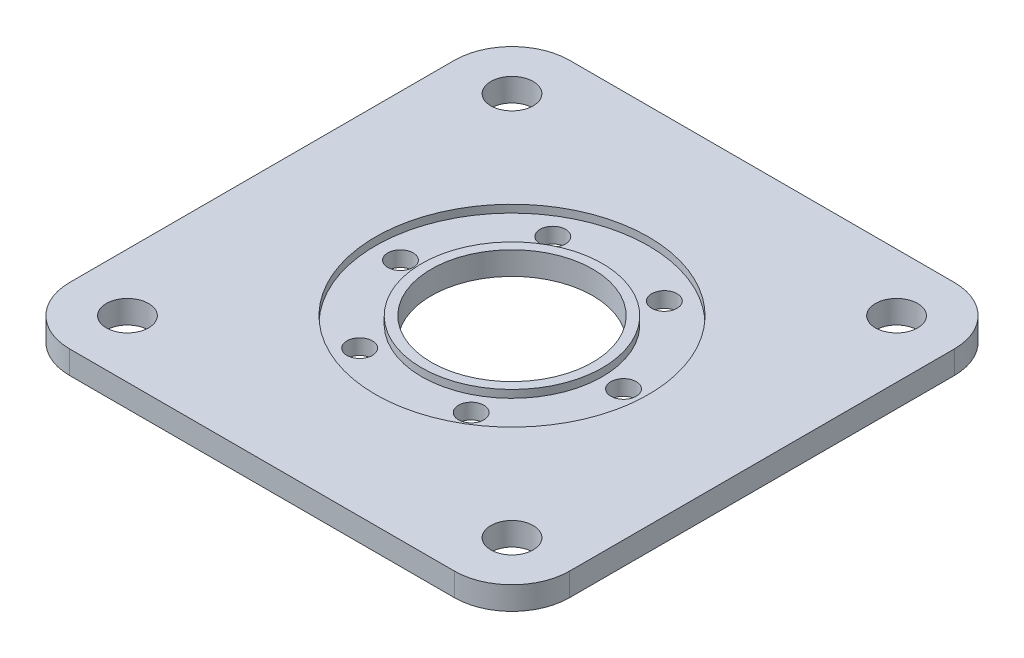
ISO-10303-21;
HEADER;
FILE_DESCRIPTION(('STEP AP214'),'2;1');
FILE_NAME('part.step','',(''),(''),'','','');
FILE_SCHEMA(('AUTOMOTIVE_DESIGN { 1 0 10303 214 1 1 1 1 }'));
ENDSEC;
DATA;
#1=APPLICATION_CONTEXT('core data for automotive mechanical design processes');
#2=APPLICATION_PROTOCOL_DEFINITION('international standard','automotive_design',2000,#1);
#3=PRODUCT_CONTEXT('',#1,'mechanical');
#4=PRODUCT('Part','Part','',(#3));
#5=PRODUCT_RELATED_PRODUCT_CATEGORY('part','',(#4));
#6=PRODUCT_DEFINITION_FORMATION('','',#4);
#7=PRODUCT_DEFINITION_CONTEXT('part definition',#1,'design');
#8=PRODUCT_DEFINITION('design','',#6,#7);
#9=PRODUCT_DEFINITION_SHAPE('','',#8);
#10=(LENGTH_UNIT() NAMED_UNIT(*) SI_UNIT(.MILLI.,.METRE.));
#11=(NAMED_UNIT(*) PLANE_ANGLE_UNIT() SI_UNIT($,.RADIAN.));
#12=(NAMED_UNIT(*) SI_UNIT($,.STERADIAN.) SOLID_ANGLE_UNIT());
#13=UNCERTAINTY_MEASURE_WITH_UNIT(LENGTH_MEASURE(1.E-05),#10,'distance_accuracy_value','');
#14=(GEOMETRIC_REPRESENTATION_CONTEXT(3) GLOBAL_UNCERTAINTY_ASSIGNED_CONTEXT((#13)) GLOBAL_UNIT_ASSIGNED_CONTEXT((#10,
#11,#12)) REPRESENTATION_CONTEXT('',''));
#15=CARTESIAN_POINT('',(0.,0.,0.));
#16=DIRECTION('',(0.,0.,1.));
#17=DIRECTION('',(1.,0.,0.));
#18=AXIS2_PLACEMENT_3D('',#15,#16,#17);
#19=CARTESIAN_POINT('',(-50.,6.,50.));
#20=DIRECTION('',(0.,-1.,0.));
#21=DIRECTION('',(0.,0.,-1.));
#22=AXIS2_PLACEMENT_3D('',#19,#20,#21);
#23=PLANE('',#22);
#24=CARTESIAN_POINT('',(0.,6.,0.));
#25=DIRECTION('',(0.,1.,0.));
#26=DIRECTION('',(0.,0.,1.));
#27=AXIS2_PLACEMENT_3D('',#24,#25,#26);
#28=CIRCLE('',#27,21.);
#29=CARTESIAN_POINT('',(0.,6.,21.));
#30=VERTEX_POINT('',#29);
#31=EDGE_CURVE('E135',#30,#30,#28,.T.);
#32=ORIENTED_EDGE('',*,*,#31,.F.);
#33=EDGE_LOOP('',(#32));
#34=FACE_BOUND('',#33,.T.);
#35=CARTESIAN_POINT('',(0.,6.,0.));
#36=DIRECTION('',(0.,1.,0.));
#37=DIRECTION('',(0.,0.,1.));
#38=AXIS2_PLACEMENT_3D('',#35,#36,#37);
#39=CIRCLE('',#38,23.5);
#40=CARTESIAN_POINT('',(0.,6.,23.5));
#41=VERTEX_POINT('',#40);
#42=EDGE_CURVE('E192',#41,#41,#39,.T.);
#43=ORIENTED_EDGE('',*,*,#42,.T.);
#44=EDGE_LOOP('',(#43));
#45=FACE_BOUND('',#44,.T.);
#46=ADVANCED_FACE('F34',(#34,#45),#23,.F.);
#47=CARTESIAN_POINT('',(-50.,6.,50.));
#48=DIRECTION('',(0.,-1.,0.));
#49=DIRECTION('',(0.,0.,-1.));
#50=AXIS2_PLACEMENT_3D('',#47,#48,#49);
#51=CIRCLE('',#50,5.5);
#52=CARTESIAN_POINT('',(-50.,6.,44.5));
#53=VERTEX_POINT('',#52);
#54=EDGE_CURVE('E195',#53,#53,#51,.T.);
#55=ORIENTED_EDGE('',*,*,#54,.T.);
#56=EDGE_LOOP('',(#55));
#57=FACE_BOUND('',#56,.T.);
#58=CARTESIAN_POINT('',(50.,6.,50.));
#59=DIRECTION('',(0.,-1.,0.));
#60=DIRECTION('',(0.,0.,-1.));
#61=AXIS2_PLACEMENT_3D('',#58,#59,#60);
#62=CIRCLE('',#61,5.5);
#63=CARTESIAN_POINT('',(50.,6.,44.5));
#64=VERTEX_POINT('',#63);
#65=EDGE_CURVE('E200',#64,#64,#62,.T.);
#66=ORIENTED_EDGE('',*,*,#65,.T.);
#67=EDGE_LOOP('',(#66));
#68=FACE_BOUND('',#67,.T.);
#69=CARTESIAN_POINT('',(50.,6.,-50.));
#70=DIRECTION('',(0.,-1.,0.));
#71=DIRECTION('',(0.,0.,-1.));
#72=AXIS2_PLACEMENT_3D('',#69,#70,#71);
#73=CIRCLE('',#72,5.5);
#74=CARTESIAN_POINT('',(50.,6.,-55.5));
#75=VERTEX_POINT('',#74);
#76=EDGE_CURVE('E203',#75,#75,#73,.T.);
#77=ORIENTED_EDGE('',*,*,#76,.T.);
#78=EDGE_LOOP('',(#77));
#79=FACE_BOUND('',#78,.T.);
#80=CARTESIAN_POINT('',(-50.,6.,-50.));
#81=DIRECTION('',(0.,-1.,0.));
#82=DIRECTION('',(0.,0.,-1.));
#83=AXIS2_PLACEMENT_3D('',#80,#81,#82);
#84=CIRCLE('',#83,5.5);
#85=CARTESIAN_POINT('',(-50.,6.,-55.5));
#86=VERTEX_POINT('',#85);
#87=EDGE_CURVE('E206',#86,#86,#84,.T.);
#88=ORIENTED_EDGE('',*,*,#87,.T.);
#89=EDGE_LOOP('',(#88));
#90=FACE_BOUND('',#89,.T.);
#91=CARTESIAN_POINT('',(0.,6.,0.));
#92=DIRECTION('',(0.,1.,0.));
#93=DIRECTION('',(0.,0.,1.));
#94=AXIS2_PLACEMENT_3D('',#91,#92,#93);
#95=CIRCLE('',#94,35.5);
#96=CARTESIAN_POINT('',(0.,6.,35.5));
#97=VERTEX_POINT('',#96);
#98=EDGE_CURVE('E186',#97,#97,#95,.T.);
#99=ORIENTED_EDGE('',*,*,#98,.F.);
#100=EDGE_LOOP('',(#99));
#101=FACE_BOUND('',#100,.T.);
#102=CARTESIAN_POINT('',(-50.,6.,50.));
#103=DIRECTION('',(0.,1.,0.));
#104=DIRECTION('',(0.,0.,-1.));
#105=AXIS2_PLACEMENT_3D('',#102,#103,#104);
#106=CIRCLE('',#105,15.);
#107=CARTESIAN_POINT('',(-65.,6.,50.));
#108=VERTEX_POINT('',#107);
#109=CARTESIAN_POINT('',(-50.,6.,65.));
#110=VERTEX_POINT('',#109);
#111=EDGE_CURVE('E146',#108,#110,#106,.T.);
#112=ORIENTED_EDGE('',*,*,#111,.T.);
#113=DIRECTION('',(1.,0.,0.));
#114=VECTOR('',#113,1.);
#115=CARTESIAN_POINT('',(-50.,6.,65.));
#116=LINE('',#115,#114);
#117=CARTESIAN_POINT('',(50.,6.,65.));
#118=VERTEX_POINT('',#117);
#119=EDGE_CURVE('E94',#110,#118,#116,.T.);
#120=ORIENTED_EDGE('',*,*,#119,.T.);
#121=CARTESIAN_POINT('',(50.,6.,50.));
#122=DIRECTION('',(0.,1.,0.));
#123=DIRECTION('',(0.,0.,1.));
#124=AXIS2_PLACEMENT_3D('',#121,#122,#123);
#125=CIRCLE('',#124,15.);
#126=CARTESIAN_POINT('',(65.,6.,50.));
#127=VERTEX_POINT('',#126);
#128=EDGE_CURVE('E161',#118,#127,#125,.T.);
#129=ORIENTED_EDGE('',*,*,#128,.T.);
#130=DIRECTION('',(0.,0.,-1.));
#131=VECTOR('',#130,1.);
#132=CARTESIAN_POINT('',(65.,6.,50.));
#133=LINE('',#132,#131);
#134=CARTESIAN_POINT('',(65.,6.,-50.));
#135=VERTEX_POINT('',#134);
#136=EDGE_CURVE('E174',#127,#135,#133,.T.);
#137=ORIENTED_EDGE('',*,*,#136,.T.);
#138=CARTESIAN_POINT('',(50.,6.,-50.));
#139=DIRECTION('',(0.,1.,0.));
#140=DIRECTION('',(0.,0.,1.));
#141=AXIS2_PLACEMENT_3D('',#138,#139,#140);
#142=CIRCLE('',#141,15.);
#143=CARTESIAN_POINT('',(50.,6.,-65.));
#144=VERTEX_POINT('',#143);
#145=EDGE_CURVE('E113',#135,#144,#142,.T.);
#146=ORIENTED_EDGE('',*,*,#145,.T.);
#147=DIRECTION('',(-1.,0.,0.));
#148=VECTOR('',#147,1.);
#149=CARTESIAN_POINT('',(-50.,6.,-65.));
#150=LINE('',#149,#148);
#151=CARTESIAN_POINT('',(-50.,6.,-65.));
#152=VERTEX_POINT('',#151);
#153=EDGE_CURVE('E107',#144,#152,#150,.T.);
#154=ORIENTED_EDGE('',*,*,#153,.T.);
#155=CARTESIAN_POINT('',(-50.,6.,-50.));
#156=DIRECTION('',(0.,1.,0.));
#157=DIRECTION('',(0.,0.,-1.));
#158=AXIS2_PLACEMENT_3D('',#155,#156,#157);
#159=CIRCLE('',#158,15.);
#160=CARTESIAN_POINT('',(-65.,6.,-50.));
#161=VERTEX_POINT('',#160);
#162=EDGE_CURVE('E111',#152,#161,#159,.T.);
#163=ORIENTED_EDGE('',*,*,#162,.T.);
#164=DIRECTION('',(0.,0.,1.));
#165=VECTOR('',#164,1.);
#166=CARTESIAN_POINT('',(-65.,6.,50.));
#167=LINE('',#166,#165);
#168=EDGE_CURVE('E51',#161,#108,#167,.T.);
#169=ORIENTED_EDGE('',*,*,#168,.T.);
#170=EDGE_LOOP('',(#112,#120,#129,#137,#146,#154,#163,#169));
#171=FACE_BOUND('',#170,.T.);
#172=ADVANCED_FACE('F109',(#57,#68,#79,#90,#101,#171),#23,.F.);
#173=CARTESIAN_POINT('',(-50.,0.,50.));
#174=DIRECTION('',(0.,-1.,0.));
#175=DIRECTION('',(0.,0.,-1.));
#176=AXIS2_PLACEMENT_3D('',#173,#174,#175);
#177=PLANE('',#176);
#178=CARTESIAN_POINT('',(-14.5000000000003,0.,-25.1147367097486));
#179=DIRECTION('',(0.,-1.,0.));
#180=DIRECTION('',(0.,0.,-1.));
#181=AXIS2_PLACEMENT_3D('',#178,#179,#180);
#182=CIRCLE('',#181,3.29999999999999);
#183=CARTESIAN_POINT('',(-14.5000000000003,0.,-28.4147367097485));
#184=VERTEX_POINT('',#183);
#185=EDGE_CURVE('E251',#184,#184,#182,.T.);
#186=ORIENTED_EDGE('',*,*,#185,.F.);
#187=EDGE_LOOP('',(#186));
#188=FACE_BOUND('',#187,.T.);
#189=CARTESIAN_POINT('',(14.4999999999998,0.,-25.1147367097489));
#190=DIRECTION('',(0.,-1.,0.));
#191=DIRECTION('',(0.,0.,-1.));
#192=AXIS2_PLACEMENT_3D('',#189,#190,#191);
#193=CIRCLE('',#192,3.29999999999999);
#194=CARTESIAN_POINT('',(14.4999999999998,0.,-28.4147367097488));
#195=VERTEX_POINT('',#194);
#196=EDGE_CURVE('E245',#195,#195,#193,.T.);
#197=ORIENTED_EDGE('',*,*,#196,.F.);
#198=EDGE_LOOP('',(#197));
#199=FACE_BOUND('',#198,.T.);
#200=CARTESIAN_POINT('',(29.,0.,0.));
#201=DIRECTION('',(0.,-1.,0.));
#202=DIRECTION('',(0.,0.,-1.));
#203=AXIS2_PLACEMENT_3D('',#200,#201,#202);
#204=CIRCLE('',#203,3.29999999999999);
#205=CARTESIAN_POINT('',(29.,0.,-3.29999999999999));
#206=VERTEX_POINT('',#205);
#207=EDGE_CURVE('E239',#206,#206,#204,.T.);
#208=ORIENTED_EDGE('',*,*,#207,.F.);
#209=EDGE_LOOP('',(#208));
#210=FACE_BOUND('',#209,.T.);
#211=CARTESIAN_POINT('',(14.5000000000001,0.,25.1147367097487));
#212=DIRECTION('',(0.,-1.,0.));
#213=DIRECTION('',(0.,0.,-1.));
#214=AXIS2_PLACEMENT_3D('',#211,#212,#213);
#215=CIRCLE('',#214,3.29999999999999);
#216=CARTESIAN_POINT('',(14.5000000000001,0.,21.8147367097487));
#217=VERTEX_POINT('',#216);
#218=EDGE_CURVE('E233',#217,#217,#215,.T.);
#219=ORIENTED_EDGE('',*,*,#218,.F.);
#220=EDGE_LOOP('',(#219));
#221=FACE_BOUND('',#220,.T.);
#222=CARTESIAN_POINT('',(-14.4999999999999,0.,25.1147367097488));
#223=DIRECTION('',(0.,-1.,0.));
#224=DIRECTION('',(0.,0.,-1.));
#225=AXIS2_PLACEMENT_3D('',#222,#223,#224);
#226=CIRCLE('',#225,3.29999999999999);
#227=CARTESIAN_POINT('',(-14.4999999999999,0.,21.8147367097488));
#228=VERTEX_POINT('',#227);
#229=EDGE_CURVE('E227',#228,#228,#226,.T.);
#230=ORIENTED_EDGE('',*,*,#229,.F.);
#231=EDGE_LOOP('',(#230));
#232=FACE_BOUND('',#231,.T.);
#233=CARTESIAN_POINT('',(-29.,0.,0.));
#234=DIRECTION('',(0.,-1.,0.));
#235=DIRECTION('',(0.,0.,-1.));
#236=AXIS2_PLACEMENT_3D('',#233,#234,#235);
#237=CIRCLE('',#236,3.29999999999999);
#238=CARTESIAN_POINT('',(-29.,0.,-3.29999999999999));
#239=VERTEX_POINT('',#238);
#240=EDGE_CURVE('E217',#239,#239,#237,.T.);
#241=ORIENTED_EDGE('',*,*,#240,.F.);
#242=EDGE_LOOP('',(#241));
#243=FACE_BOUND('',#242,.T.);
#244=CARTESIAN_POINT('',(-50.,0.,50.));
#245=DIRECTION('',(0.,1.,0.));
#246=DIRECTION('',(0.,0.,1.));
#247=AXIS2_PLACEMENT_3D('',#244,#245,#246);
#248=CIRCLE('',#247,5.5);
#249=CARTESIAN_POINT('',(-50.,0.,55.5));
#250=VERTEX_POINT('',#249);
#251=EDGE_CURVE('E213',#250,#250,#248,.T.);
#252=ORIENTED_EDGE('',*,*,#251,.T.);
#253=EDGE_LOOP('',(#252));
#254=FACE_BOUND('',#253,.T.);
#255=CARTESIAN_POINT('',(50.,0.,50.));
#256=DIRECTION('',(0.,1.,0.));
#257=DIRECTION('',(0.,0.,1.));
#258=AXIS2_PLACEMENT_3D('',#255,#256,#257);
#259=CIRCLE('',#258,5.5);
#260=CARTESIAN_POINT('',(50.,0.,55.5));
#261=VERTEX_POINT('',#260);
#262=EDGE_CURVE('E216',#261,#261,#259,.T.);
#263=ORIENTED_EDGE('',*,*,#262,.T.);
#264=EDGE_LOOP('',(#263));
#265=FACE_BOUND('',#264,.T.);
#266=CARTESIAN_POINT('',(50.,0.,-50.));
#267=DIRECTION('',(0.,1.,0.));
#268=DIRECTION('',(0.,0.,1.));
#269=AXIS2_PLACEMENT_3D('',#266,#267,#268);
#270=CIRCLE('',#269,5.5);
#271=CARTESIAN_POINT('',(50.,0.,-44.5));
#272=VERTEX_POINT('',#271);
#273=EDGE_CURVE('E212',#272,#272,#270,.T.);
#274=ORIENTED_EDGE('',*,*,#273,.T.);
#275=EDGE_LOOP('',(#274));
#276=FACE_BOUND('',#275,.T.);
#277=CARTESIAN_POINT('',(-50.,0.,-50.));
#278=DIRECTION('',(0.,1.,0.));
#279=DIRECTION('',(0.,0.,1.));
#280=AXIS2_PLACEMENT_3D('',#277,#278,#279);
#281=CIRCLE('',#280,5.5);
#282=CARTESIAN_POINT('',(-50.,0.,-44.5));
#283=VERTEX_POINT('',#282);
#284=EDGE_CURVE('E209',#283,#283,#281,.T.);
#285=ORIENTED_EDGE('',*,*,#284,.T.);
#286=EDGE_LOOP('',(#285));
#287=FACE_BOUND('',#286,.T.);
#288=CARTESIAN_POINT('',(-50.,0.,50.));
#289=DIRECTION('',(0.,1.,0.));
#290=DIRECTION('',(0.,0.,-1.));
#291=AXIS2_PLACEMENT_3D('',#288,#289,#290);
#292=CIRCLE('',#291,15.);
#293=CARTESIAN_POINT('',(-65.,0.,50.));
#294=VERTEX_POINT('',#293);
#295=CARTESIAN_POINT('',(-50.,0.,65.));
#296=VERTEX_POINT('',#295);
#297=EDGE_CURVE('E131',#294,#296,#292,.T.);
#298=ORIENTED_EDGE('',*,*,#297,.F.);
#299=DIRECTION('',(0.,0.,1.));
#300=VECTOR('',#299,1.);
#301=CARTESIAN_POINT('',(-65.,0.,50.));
#302=LINE('',#301,#300);
#303=CARTESIAN_POINT('',(-65.,0.,-50.));
#304=VERTEX_POINT('',#303);
#305=EDGE_CURVE('E86',#304,#294,#302,.T.);
#306=ORIENTED_EDGE('',*,*,#305,.F.);
#307=CARTESIAN_POINT('',(-50.,0.,-50.));
#308=DIRECTION('',(0.,1.,0.));
#309=DIRECTION('',(0.,0.,-1.));
#310=AXIS2_PLACEMENT_3D('',#307,#308,#309);
#311=CIRCLE('',#310,15.);
#312=CARTESIAN_POINT('',(-50.,0.,-65.));
#313=VERTEX_POINT('',#312);
#314=EDGE_CURVE('E80',#313,#304,#311,.T.);
#315=ORIENTED_EDGE('',*,*,#314,.F.);
#316=DIRECTION('',(-1.,0.,0.));
#317=VECTOR('',#316,1.);
#318=CARTESIAN_POINT('',(-50.,0.,-65.));
#319=LINE('',#318,#317);
#320=CARTESIAN_POINT('',(50.,0.,-65.));
#321=VERTEX_POINT('',#320);
#322=EDGE_CURVE('E121',#321,#313,#319,.T.);
#323=ORIENTED_EDGE('',*,*,#322,.F.);
#324=CARTESIAN_POINT('',(50.,0.,-50.));
#325=DIRECTION('',(0.,1.,0.));
#326=DIRECTION('',(0.,0.,1.));
#327=AXIS2_PLACEMENT_3D('',#324,#325,#326);
#328=CIRCLE('',#327,15.);
#329=CARTESIAN_POINT('',(65.,0.,-50.));
#330=VERTEX_POINT('',#329);
#331=EDGE_CURVE('E141',#330,#321,#328,.T.);
#332=ORIENTED_EDGE('',*,*,#331,.F.);
#333=DIRECTION('',(0.,0.,-1.));
#334=VECTOR('',#333,1.);
#335=CARTESIAN_POINT('',(65.,0.,50.));
#336=LINE('',#335,#334);
#337=CARTESIAN_POINT('',(65.,0.,50.));
#338=VERTEX_POINT('',#337);
#339=EDGE_CURVE('E139',#338,#330,#336,.T.);
#340=ORIENTED_EDGE('',*,*,#339,.F.);
#341=CARTESIAN_POINT('',(50.,0.,50.));
#342=DIRECTION('',(0.,1.,0.));
#343=DIRECTION('',(0.,0.,1.));
#344=AXIS2_PLACEMENT_3D('',#341,#342,#343);
#345=CIRCLE('',#344,15.);
#346=CARTESIAN_POINT('',(50.,0.,65.));
#347=VERTEX_POINT('',#346);
#348=EDGE_CURVE('E137',#347,#338,#345,.T.);
#349=ORIENTED_EDGE('',*,*,#348,.F.);
#350=DIRECTION('',(1.,0.,0.));
#351=VECTOR('',#350,1.);
#352=CARTESIAN_POINT('',(-50.,0.,65.));
#353=LINE('',#352,#351);
#354=EDGE_CURVE('E134',#296,#347,#353,.T.);
#355=ORIENTED_EDGE('',*,*,#354,.F.);
#356=EDGE_LOOP('',(#298,#306,#315,#323,#332,#340,#349,#355));
#357=FACE_BOUND('',#356,.T.);
#358=CARTESIAN_POINT('',(0.,0.,0.));
#359=DIRECTION('',(0.,1.,0.));
#360=DIRECTION('',(0.,0.,1.));
#361=AXIS2_PLACEMENT_3D('',#358,#359,#360);
#362=CIRCLE('',#361,21.);
#363=CARTESIAN_POINT('',(0.,0.,21.));
#364=VERTEX_POINT('',#363);
#365=EDGE_CURVE('E180',#364,#364,#362,.T.);
#366=ORIENTED_EDGE('',*,*,#365,.T.);
#367=EDGE_LOOP('',(#366));
#368=FACE_BOUND('',#367,.T.);
#369=ADVANCED_FACE('F165',(#188,#199,#210,#221,#232,#243,#254,#265,#276,#287,#357,#368),#177,.T.);
#370=CARTESIAN_POINT('',(-50.,6.,50.));
#371=DIRECTION('',(0.,-1.,0.));
#372=DIRECTION('',(0.,0.,-1.));
#373=AXIS2_PLACEMENT_3D('',#370,#371,#372);
#374=CYLINDRICAL_SURFACE('',#373,15.);
#375=ORIENTED_EDGE('',*,*,#297,.T.);
#376=DIRECTION('',(0.,-1.,0.));
#377=VECTOR('',#376,1.);
#378=CARTESIAN_POINT('',(-50.,6.,65.));
#379=LINE('',#378,#377);
#380=EDGE_CURVE('E11',#110,#296,#379,.T.);
#381=ORIENTED_EDGE('',*,*,#380,.F.);
#382=ORIENTED_EDGE('',*,*,#111,.F.);
#383=DIRECTION('',(0.,-1.,0.));
#384=VECTOR('',#383,1.);
#385=CARTESIAN_POINT('',(-65.,6.,50.));
#386=LINE('',#385,#384);
#387=EDGE_CURVE('E127',#108,#294,#386,.T.);
#388=ORIENTED_EDGE('',*,*,#387,.T.);
#389=EDGE_LOOP('',(#375,#381,#382,#388));
#390=FACE_BOUND('',#389,.T.);
#391=ADVANCED_FACE('F36',(#390),#374,.T.);
#392=CARTESIAN_POINT('',(-50.,6.,65.));
#393=DIRECTION('',(0.,0.,-1.));
#394=DIRECTION('',(-1.,0.,0.));
#395=AXIS2_PLACEMENT_3D('',#392,#393,#394);
#396=PLANE('',#395);
#397=ORIENTED_EDGE('',*,*,#354,.T.);
#398=DIRECTION('',(0.,-1.,0.));
#399=VECTOR('',#398,1.);
#400=CARTESIAN_POINT('',(50.,6.,65.));
#401=LINE('',#400,#399);
#402=EDGE_CURVE('E43',#118,#347,#401,.T.);
#403=ORIENTED_EDGE('',*,*,#402,.F.);
#404=ORIENTED_EDGE('',*,*,#119,.F.);
#405=ORIENTED_EDGE('',*,*,#380,.T.);
#406=EDGE_LOOP('',(#397,#403,#404,#405));
#407=FACE_BOUND('',#406,.T.);
#408=ADVANCED_FACE('F312',(#407),#396,.F.);
#409=CARTESIAN_POINT('',(50.,6.,50.));
#410=DIRECTION('',(0.,-1.,0.));
#411=DIRECTION('',(0.,0.,-1.));
#412=AXIS2_PLACEMENT_3D('',#409,#410,#411);
#413=CYLINDRICAL_SURFACE('',#412,15.);
#414=ORIENTED_EDGE('',*,*,#348,.T.);
#415=DIRECTION('',(0.,-1.,0.));
#416=VECTOR('',#415,1.);
#417=CARTESIAN_POINT('',(65.,6.,50.));
#418=LINE('',#417,#416);
#419=EDGE_CURVE('E153',#127,#338,#418,.T.);
#420=ORIENTED_EDGE('',*,*,#419,.F.);
#421=ORIENTED_EDGE('',*,*,#128,.F.);
#422=ORIENTED_EDGE('',*,*,#402,.T.);
#423=EDGE_LOOP('',(#414,#420,#421,#422));
#424=FACE_BOUND('',#423,.T.);
#425=ADVANCED_FACE('F159',(#424),#413,.T.);
#426=CARTESIAN_POINT('',(65.,6.,50.));
#427=DIRECTION('',(-1.,0.,0.));
#428=DIRECTION('',(0.,0.,1.));
#429=AXIS2_PLACEMENT_3D('',#426,#427,#428);
#430=PLANE('',#429);
#431=ORIENTED_EDGE('',*,*,#339,.T.);
#432=DIRECTION('',(0.,-1.,0.));
#433=VECTOR('',#432,1.);
#434=CARTESIAN_POINT('',(65.,6.,-50.));
#435=LINE('',#434,#433);
#436=EDGE_CURVE('E150',#135,#330,#435,.T.);
#437=ORIENTED_EDGE('',*,*,#436,.F.);
#438=ORIENTED_EDGE('',*,*,#136,.F.);
#439=ORIENTED_EDGE('',*,*,#419,.T.);
#440=EDGE_LOOP('',(#431,#437,#438,#439));
#441=FACE_BOUND('',#440,.T.);
#442=ADVANCED_FACE('F170',(#441),#430,.F.);
#443=CARTESIAN_POINT('',(50.,6.,-50.));
#444=DIRECTION('',(0.,-1.,0.));
#445=DIRECTION('',(0.,0.,-1.));
#446=AXIS2_PLACEMENT_3D('',#443,#444,#445);
#447=CYLINDRICAL_SURFACE('',#446,15.);
#448=ORIENTED_EDGE('',*,*,#331,.T.);
#449=DIRECTION('',(0.,-1.,0.));
#450=VECTOR('',#449,1.);
#451=CARTESIAN_POINT('',(50.,6.,-65.));
#452=LINE('',#451,#450);
#453=EDGE_CURVE('E122',#144,#321,#452,.T.);
#454=ORIENTED_EDGE('',*,*,#453,.F.);
#455=ORIENTED_EDGE('',*,*,#145,.F.);
#456=ORIENTED_EDGE('',*,*,#436,.T.);
#457=EDGE_LOOP('',(#448,#454,#455,#456));
#458=FACE_BOUND('',#457,.T.);
#459=ADVANCED_FACE('F173',(#458),#447,.T.);
#460=CARTESIAN_POINT('',(-50.,6.,-65.));
#461=DIRECTION('',(0.,0.,1.));
#462=DIRECTION('',(1.,0.,0.));
#463=AXIS2_PLACEMENT_3D('',#460,#461,#462);
#464=PLANE('',#463);
#465=ORIENTED_EDGE('',*,*,#322,.T.);
#466=DIRECTION('',(0.,-1.,0.));
#467=VECTOR('',#466,1.);
#468=CARTESIAN_POINT('',(-50.,6.,-65.));
#469=LINE('',#468,#467);
#470=EDGE_CURVE('E118',#152,#313,#469,.T.);
#471=ORIENTED_EDGE('',*,*,#470,.F.);
#472=ORIENTED_EDGE('',*,*,#153,.F.);
#473=ORIENTED_EDGE('',*,*,#453,.T.);
#474=EDGE_LOOP('',(#465,#471,#472,#473));
#475=FACE_BOUND('',#474,.T.);
#476=ADVANCED_FACE('F119',(#475),#464,.F.);
#477=CARTESIAN_POINT('',(-50.,6.,-50.));
#478=DIRECTION('',(0.,-1.,0.));
#479=DIRECTION('',(0.,0.,-1.));
#480=AXIS2_PLACEMENT_3D('',#477,#478,#479);
#481=CYLINDRICAL_SURFACE('',#480,15.);
#482=ORIENTED_EDGE('',*,*,#314,.T.);
#483=DIRECTION('',(0.,-1.,0.));
#484=VECTOR('',#483,1.);
#485=CARTESIAN_POINT('',(-65.,6.,-50.));
#486=LINE('',#485,#484);
#487=EDGE_CURVE('E123',#161,#304,#486,.T.);
#488=ORIENTED_EDGE('',*,*,#487,.F.);
#489=ORIENTED_EDGE('',*,*,#162,.F.);
#490=ORIENTED_EDGE('',*,*,#470,.T.);
#491=EDGE_LOOP('',(#482,#488,#489,#490));
#492=FACE_BOUND('',#491,.T.);
#493=ADVANCED_FACE('F125',(#492),#481,.T.);
#494=CARTESIAN_POINT('',(-65.,6.,50.));
#495=DIRECTION('',(1.,0.,0.));
#496=DIRECTION('',(0.,0.,-1.));
#497=AXIS2_PLACEMENT_3D('',#494,#495,#496);
#498=PLANE('',#497);
#499=ORIENTED_EDGE('',*,*,#305,.T.);
#500=ORIENTED_EDGE('',*,*,#387,.F.);
#501=ORIENTED_EDGE('',*,*,#168,.F.);
#502=ORIENTED_EDGE('',*,*,#487,.T.);
#503=EDGE_LOOP('',(#499,#500,#501,#502));
#504=FACE_BOUND('',#503,.T.);
#505=ADVANCED_FACE('F300',(#504),#498,.F.);
#506=CARTESIAN_POINT('',(0.,6.,0.));
#507=DIRECTION('',(0.,-1.,0.));
#508=DIRECTION('',(0.,0.,-1.));
#509=AXIS2_PLACEMENT_3D('',#506,#507,#508);
#510=CYLINDRICAL_SURFACE('',#509,21.);
#511=ORIENTED_EDGE('',*,*,#31,.T.);
#512=EDGE_LOOP('',(#511));
#513=FACE_BOUND('',#512,.T.);
#514=ORIENTED_EDGE('',*,*,#365,.F.);
#515=EDGE_LOOP('',(#514));
#516=FACE_BOUND('',#515,.T.);
#517=ADVANCED_FACE('F283',(#513,#516),#510,.F.);
#518=CARTESIAN_POINT('',(0.,4.,0.));
#519=DIRECTION('',(0.,1.,0.));
#520=DIRECTION('',(0.,0.,1.));
#521=AXIS2_PLACEMENT_3D('',#518,#519,#520);
#522=CYLINDRICAL_SURFACE('',#521,35.5);
#523=CARTESIAN_POINT('',(0.,4.,0.));
#524=DIRECTION('',(0.,1.,0.));
#525=DIRECTION('',(0.,0.,1.));
#526=AXIS2_PLACEMENT_3D('',#523,#524,#525);
#527=CIRCLE('',#526,35.5);
#528=CARTESIAN_POINT('',(0.,4.,35.5));
#529=VERTEX_POINT('',#528);
#530=EDGE_CURVE('E183',#529,#529,#527,.T.);
#531=ORIENTED_EDGE('',*,*,#530,.F.);
#532=EDGE_LOOP('',(#531));
#533=FACE_BOUND('',#532,.T.);
#534=ORIENTED_EDGE('',*,*,#98,.T.);
#535=EDGE_LOOP('',(#534));
#536=FACE_BOUND('',#535,.T.);
#537=ADVANCED_FACE('F265',(#533,#536),#522,.F.);
#538=CARTESIAN_POINT('',(0.,4.,0.));
#539=DIRECTION('',(0.,1.,0.));
#540=DIRECTION('',(0.,0.,1.));
#541=AXIS2_PLACEMENT_3D('',#538,#539,#540);
#542=PLANE('',#541);
#543=CARTESIAN_POINT('',(-14.5000000000003,4.,-25.1147367097486));
#544=DIRECTION('',(0.,1.,0.));
#545=DIRECTION('',(0.,0.,1.));
#546=AXIS2_PLACEMENT_3D('',#543,#544,#545);
#547=CIRCLE('',#546,3.29999999999999);
#548=CARTESIAN_POINT('',(-14.5000000000003,4.,-21.8147367097486));
#549=VERTEX_POINT('',#548);
#550=EDGE_CURVE('E254',#549,#549,#547,.T.);
#551=ORIENTED_EDGE('',*,*,#550,.F.);
#552=EDGE_LOOP('',(#551));
#553=FACE_BOUND('',#552,.T.);
#554=CARTESIAN_POINT('',(14.4999999999998,4.,-25.1147367097489));
#555=DIRECTION('',(0.,1.,0.));
#556=DIRECTION('',(0.,0.,1.));
#557=AXIS2_PLACEMENT_3D('',#554,#555,#556);
#558=CIRCLE('',#557,3.29999999999999);
#559=CARTESIAN_POINT('',(14.4999999999998,4.,-21.8147367097489));
#560=VERTEX_POINT('',#559);
#561=EDGE_CURVE('E248',#560,#560,#558,.T.);
#562=ORIENTED_EDGE('',*,*,#561,.F.);
#563=EDGE_LOOP('',(#562));
#564=FACE_BOUND('',#563,.T.);
#565=CARTESIAN_POINT('',(29.,4.,0.));
#566=DIRECTION('',(0.,1.,0.));
#567=DIRECTION('',(0.,0.,1.));
#568=AXIS2_PLACEMENT_3D('',#565,#566,#567);
#569=CIRCLE('',#568,3.29999999999999);
#570=CARTESIAN_POINT('',(29.,4.,3.29999999999999));
#571=VERTEX_POINT('',#570);
#572=EDGE_CURVE('E242',#571,#571,#569,.T.);
#573=ORIENTED_EDGE('',*,*,#572,.F.);
#574=EDGE_LOOP('',(#573));
#575=FACE_BOUND('',#574,.T.);
#576=CARTESIAN_POINT('',(14.5000000000001,4.,25.1147367097487));
#577=DIRECTION('',(0.,1.,0.));
#578=DIRECTION('',(0.,0.,1.));
#579=AXIS2_PLACEMENT_3D('',#576,#577,#578);
#580=CIRCLE('',#579,3.29999999999999);
#581=CARTESIAN_POINT('',(14.5000000000001,4.,28.4147367097486));
#582=VERTEX_POINT('',#581);
#583=EDGE_CURVE('E236',#582,#582,#580,.T.);
#584=ORIENTED_EDGE('',*,*,#583,.F.);
#585=EDGE_LOOP('',(#584));
#586=FACE_BOUND('',#585,.T.);
#587=CARTESIAN_POINT('',(-14.4999999999999,4.,25.1147367097488));
#588=DIRECTION('',(0.,1.,0.));
#589=DIRECTION('',(0.,0.,1.));
#590=AXIS2_PLACEMENT_3D('',#587,#588,#589);
#591=CIRCLE('',#590,3.29999999999999);
#592=CARTESIAN_POINT('',(-14.4999999999999,4.,28.4147367097487));
#593=VERTEX_POINT('',#592);
#594=EDGE_CURVE('E230',#593,#593,#591,.T.);
#595=ORIENTED_EDGE('',*,*,#594,.F.);
#596=EDGE_LOOP('',(#595));
#597=FACE_BOUND('',#596,.T.);
#598=CARTESIAN_POINT('',(-29.,4.,0.));
#599=DIRECTION('',(0.,1.,0.));
#600=DIRECTION('',(0.,0.,1.));
#601=AXIS2_PLACEMENT_3D('',#598,#599,#600);
#602=CIRCLE('',#601,3.29999999999999);
#603=CARTESIAN_POINT('',(-29.,4.,3.29999999999999));
#604=VERTEX_POINT('',#603);
#605=EDGE_CURVE('E224',#604,#604,#602,.T.);
#606=ORIENTED_EDGE('',*,*,#605,.F.);
#607=EDGE_LOOP('',(#606));
#608=FACE_BOUND('',#607,.T.);
#609=CARTESIAN_POINT('',(0.,4.,0.));
#610=DIRECTION('',(0.,1.,0.));
#611=DIRECTION('',(0.,0.,1.));
#612=AXIS2_PLACEMENT_3D('',#609,#610,#611);
#613=CIRCLE('',#612,23.5);
#614=CARTESIAN_POINT('',(0.,4.,23.5));
#615=VERTEX_POINT('',#614);
#616=EDGE_CURVE('E189',#615,#615,#613,.T.);
#617=ORIENTED_EDGE('',*,*,#616,.F.);
#618=EDGE_LOOP('',(#617));
#619=FACE_BOUND('',#618,.T.);
#620=ORIENTED_EDGE('',*,*,#530,.T.);
#621=EDGE_LOOP('',(#620));
#622=FACE_BOUND('',#621,.T.);
#623=ADVANCED_FACE('F261',(#553,#564,#575,#586,#597,#608,#619,#622),#542,.T.);
#624=CARTESIAN_POINT('',(0.,4.,0.));
#625=DIRECTION('',(0.,1.,0.));
#626=DIRECTION('',(0.,0.,1.));
#627=AXIS2_PLACEMENT_3D('',#624,#625,#626);
#628=CYLINDRICAL_SURFACE('',#627,23.5);
#629=ORIENTED_EDGE('',*,*,#616,.T.);
#630=EDGE_LOOP('',(#629));
#631=FACE_BOUND('',#630,.T.);
#632=ORIENTED_EDGE('',*,*,#42,.F.);
#633=EDGE_LOOP('',(#632));
#634=FACE_BOUND('',#633,.T.);
#635=ADVANCED_FACE('F264',(#631,#634),#628,.T.);
#636=CARTESIAN_POINT('',(-50.,0.,-50.));
#637=DIRECTION('',(0.,1.,0.));
#638=DIRECTION('',(0.,0.,1.));
#639=AXIS2_PLACEMENT_3D('',#636,#637,#638);
#640=CYLINDRICAL_SURFACE('',#639,5.5);
#641=ORIENTED_EDGE('',*,*,#284,.F.);
#642=EDGE_LOOP('',(#641));
#643=FACE_BOUND('',#642,.T.);
#644=ORIENTED_EDGE('',*,*,#87,.F.);
#645=EDGE_LOOP('',(#644));
#646=FACE_BOUND('',#645,.T.);
#647=ADVANCED_FACE('F402',(#643,#646),#640,.F.);
#648=CARTESIAN_POINT('',(50.,0.,-50.));
#649=DIRECTION('',(0.,1.,0.));
#650=DIRECTION('',(0.,0.,1.));
#651=AXIS2_PLACEMENT_3D('',#648,#649,#650);
#652=CYLINDRICAL_SURFACE('',#651,5.5);
#653=ORIENTED_EDGE('',*,*,#273,.F.);
#654=EDGE_LOOP('',(#653));
#655=FACE_BOUND('',#654,.T.);
#656=ORIENTED_EDGE('',*,*,#76,.F.);
#657=EDGE_LOOP('',(#656));
#658=FACE_BOUND('',#657,.T.);
#659=ADVANCED_FACE('F398',(#655,#658),#652,.F.);
#660=CARTESIAN_POINT('',(50.,0.,50.));
#661=DIRECTION('',(0.,1.,0.));
#662=DIRECTION('',(0.,0.,1.));
#663=AXIS2_PLACEMENT_3D('',#660,#661,#662);
#664=CYLINDRICAL_SURFACE('',#663,5.5);
#665=ORIENTED_EDGE('',*,*,#262,.F.);
#666=EDGE_LOOP('',(#665));
#667=FACE_BOUND('',#666,.T.);
#668=ORIENTED_EDGE('',*,*,#65,.F.);
#669=EDGE_LOOP('',(#668));
#670=FACE_BOUND('',#669,.T.);
#671=ADVANCED_FACE('F401',(#667,#670),#664,.F.);
#672=CARTESIAN_POINT('',(-50.,0.,50.));
#673=DIRECTION('',(0.,1.,0.));
#674=DIRECTION('',(0.,0.,1.));
#675=AXIS2_PLACEMENT_3D('',#672,#673,#674);
#676=CYLINDRICAL_SURFACE('',#675,5.5);
#677=ORIENTED_EDGE('',*,*,#251,.F.);
#678=EDGE_LOOP('',(#677));
#679=FACE_BOUND('',#678,.T.);
#680=ORIENTED_EDGE('',*,*,#54,.F.);
#681=EDGE_LOOP('',(#680));
#682=FACE_BOUND('',#681,.T.);
#683=ADVANCED_FACE('F396',(#679,#682),#676,.F.);
#684=CARTESIAN_POINT('',(-29.,4.,0.));
#685=DIRECTION('',(0.,1.,0.));
#686=DIRECTION('',(0.,0.,1.));
#687=AXIS2_PLACEMENT_3D('',#684,#685,#686);
#688=CYLINDRICAL_SURFACE('',#687,3.29999999999999);
#689=ORIENTED_EDGE('',*,*,#605,.T.);
#690=EDGE_LOOP('',(#689));
#691=FACE_BOUND('',#690,.T.);
#692=ORIENTED_EDGE('',*,*,#240,.T.);
#693=EDGE_LOOP('',(#692));
#694=FACE_BOUND('',#693,.T.);
#695=ADVANCED_FACE('F333',(#691,#694),#688,.F.);
#696=CARTESIAN_POINT('',(-14.4999999999999,4.,25.1147367097488));
#697=DIRECTION('',(0.,1.,0.));
#698=DIRECTION('',(0.,0.,1.));
#699=AXIS2_PLACEMENT_3D('',#696,#697,#698);
#700=CYLINDRICAL_SURFACE('',#699,3.29999999999999);
#701=ORIENTED_EDGE('',*,*,#594,.T.);
#702=EDGE_LOOP('',(#701));
#703=FACE_BOUND('',#702,.T.);
#704=ORIENTED_EDGE('',*,*,#229,.T.);
#705=EDGE_LOOP('',(#704));
#706=FACE_BOUND('',#705,.T.);
#707=ADVANCED_FACE('F347',(#703,#706),#700,.F.);
#708=CARTESIAN_POINT('',(14.5000000000001,4.,25.1147367097487));
#709=DIRECTION('',(0.,1.,0.));
#710=DIRECTION('',(0.,0.,1.));
#711=AXIS2_PLACEMENT_3D('',#708,#709,#710);
#712=CYLINDRICAL_SURFACE('',#711,3.29999999999999);
#713=ORIENTED_EDGE('',*,*,#583,.T.);
#714=EDGE_LOOP('',(#713));
#715=FACE_BOUND('',#714,.T.);
#716=ORIENTED_EDGE('',*,*,#218,.T.);
#717=EDGE_LOOP('',(#716));
#718=FACE_BOUND('',#717,.T.);
#719=ADVANCED_FACE('F352',(#715,#718),#712,.F.);
#720=CARTESIAN_POINT('',(29.,4.,0.));
#721=DIRECTION('',(0.,1.,0.));
#722=DIRECTION('',(0.,0.,1.));
#723=AXIS2_PLACEMENT_3D('',#720,#721,#722);
#724=CYLINDRICAL_SURFACE('',#723,3.29999999999999);
#725=ORIENTED_EDGE('',*,*,#572,.T.);
#726=EDGE_LOOP('',(#725));
#727=FACE_BOUND('',#726,.T.);
#728=ORIENTED_EDGE('',*,*,#207,.T.);
#729=EDGE_LOOP('',(#728));
#730=FACE_BOUND('',#729,.T.);
#731=ADVANCED_FACE('F362',(#727,#730),#724,.F.);
#732=CARTESIAN_POINT('',(14.4999999999998,4.,-25.1147367097489));
#733=DIRECTION('',(0.,1.,0.));
#734=DIRECTION('',(0.,0.,1.));
#735=AXIS2_PLACEMENT_3D('',#732,#733,#734);
#736=CYLINDRICAL_SURFACE('',#735,3.29999999999999);
#737=ORIENTED_EDGE('',*,*,#561,.T.);
#738=EDGE_LOOP('',(#737));
#739=FACE_BOUND('',#738,.T.);
#740=ORIENTED_EDGE('',*,*,#196,.T.);
#741=EDGE_LOOP('',(#740));
#742=FACE_BOUND('',#741,.T.);
#743=ADVANCED_FACE('F372',(#739,#742),#736,.F.);
#744=CARTESIAN_POINT('',(-14.5000000000003,4.,-25.1147367097486));
#745=DIRECTION('',(0.,1.,0.));
#746=DIRECTION('',(0.,0.,1.));
#747=AXIS2_PLACEMENT_3D('',#744,#745,#746);
#748=CYLINDRICAL_SURFACE('',#747,3.29999999999999);
#749=ORIENTED_EDGE('',*,*,#550,.T.);
#750=EDGE_LOOP('',(#749));
#751=FACE_BOUND('',#750,.T.);
#752=ORIENTED_EDGE('',*,*,#185,.T.);
#753=EDGE_LOOP('',(#752));
#754=FACE_BOUND('',#753,.T.);
#755=ADVANCED_FACE('F258',(#751,#754),#748,.F.);
#756=CLOSED_SHELL('',(#46,#172,#369,#391,#408,#425,#442,#459,#476,#493,#505,#517,#537,#623,#635,
#647,#659,#671,#683,#695,#707,#719,#731,#743,#755));
#757=MANIFOLD_SOLID_BREP('B2',#756);
#758=ADVANCED_BREP_SHAPE_REPRESENTATION('',(#18,#757),#14);
#759=SHAPE_DEFINITION_REPRESENTATION(#9,#758);
ENDSEC;
END-ISO-10303-21;
